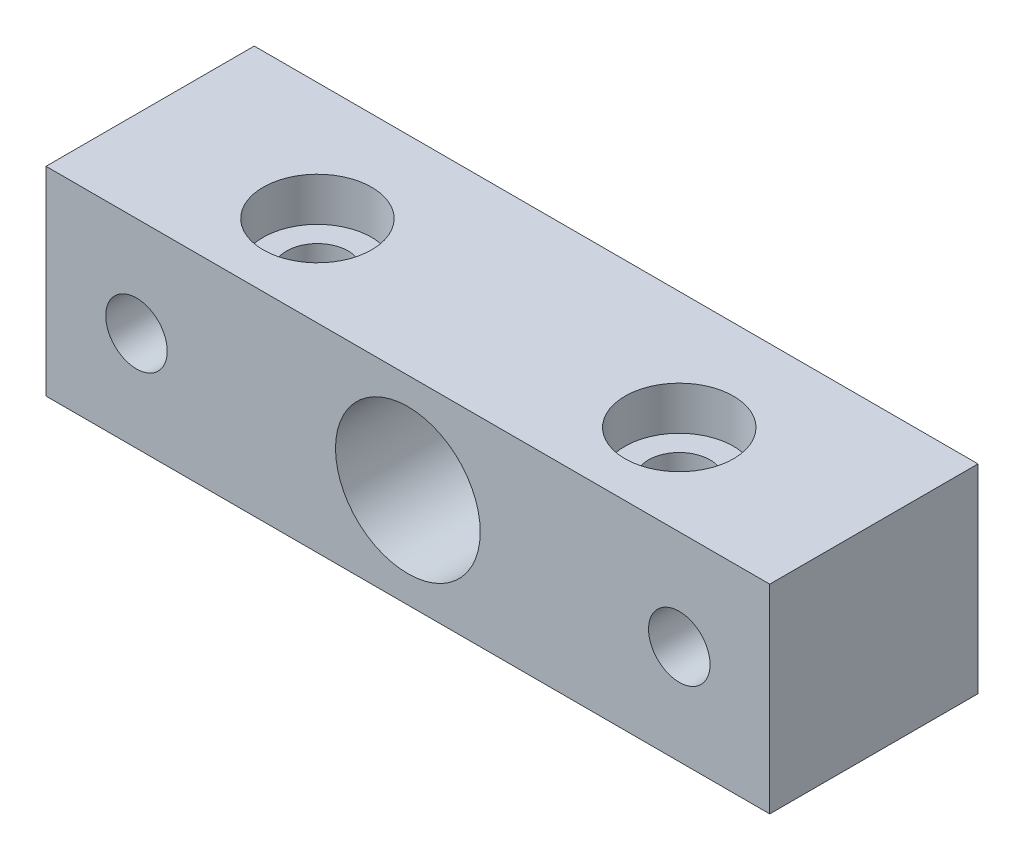
ISO-10303-21;
HEADER;
FILE_DESCRIPTION(('STEP AP214'),'2;1');
FILE_NAME('part.step','',(''),(''),'','','');
FILE_SCHEMA(('AUTOMOTIVE_DESIGN { 1 0 10303 214 1 1 1 1 }'));
ENDSEC;
DATA;
#1=APPLICATION_CONTEXT('core data for automotive mechanical design processes');
#2=APPLICATION_PROTOCOL_DEFINITION('international standard','automotive_design',2000,#1);
#3=PRODUCT_CONTEXT('',#1,'mechanical');
#4=PRODUCT('Part','Part','',(#3));
#5=PRODUCT_RELATED_PRODUCT_CATEGORY('part','',(#4));
#6=PRODUCT_DEFINITION_FORMATION('','',#4);
#7=PRODUCT_DEFINITION_CONTEXT('part definition',#1,'design');
#8=PRODUCT_DEFINITION('design','',#6,#7);
#9=PRODUCT_DEFINITION_SHAPE('','',#8);
#10=(LENGTH_UNIT() NAMED_UNIT(*) SI_UNIT(.MILLI.,.METRE.));
#11=(NAMED_UNIT(*) PLANE_ANGLE_UNIT() SI_UNIT($,.RADIAN.));
#12=(NAMED_UNIT(*) SI_UNIT($,.STERADIAN.) SOLID_ANGLE_UNIT());
#13=UNCERTAINTY_MEASURE_WITH_UNIT(LENGTH_MEASURE(1.E-05),#10,'distance_accuracy_value','');
#14=(GEOMETRIC_REPRESENTATION_CONTEXT(3) GLOBAL_UNCERTAINTY_ASSIGNED_CONTEXT((#13)) GLOBAL_UNIT_ASSIGNED_CONTEXT((#10,
#11,#12)) REPRESENTATION_CONTEXT('',''));
#15=CARTESIAN_POINT('',(0.,0.,0.));
#16=DIRECTION('',(0.,0.,1.));
#17=DIRECTION('',(1.,0.,0.));
#18=AXIS2_PLACEMENT_3D('',#15,#16,#17);
#19=CARTESIAN_POINT('',(-20.,-5.5,10.51));
#20=DIRECTION('',(1.,0.,0.));
#21=DIRECTION('',(0.,1.,0.));
#22=AXIS2_PLACEMENT_3D('',#19,#20,#21);
#23=PLANE('',#22);
#24=DIRECTION('',(0.,1.,0.));
#25=VECTOR('',#24,1.);
#26=CARTESIAN_POINT('',(-20.,-5.5,3.));
#27=LINE('',#26,#25);
#28=CARTESIAN_POINT('',(-20.,-5.5,3.));
#29=VERTEX_POINT('',#28);
#30=CARTESIAN_POINT('',(-20.,5.5,3.));
#31=VERTEX_POINT('',#30);
#32=EDGE_CURVE('E49',#29,#31,#27,.T.);
#33=ORIENTED_EDGE('',*,*,#32,.F.);
#34=DIRECTION('',(0.,0.,-1.));
#35=VECTOR('',#34,1.);
#36=CARTESIAN_POINT('',(-20.,-5.5,10.51));
#37=LINE('',#36,#35);
#38=CARTESIAN_POINT('',(-20.,-5.5,14.51));
#39=VERTEX_POINT('',#38);
#40=EDGE_CURVE('E11',#39,#29,#37,.T.);
#41=ORIENTED_EDGE('',*,*,#40,.F.);
#42=DIRECTION('',(0.,-1.,0.));
#43=VECTOR('',#42,1.);
#44=CARTESIAN_POINT('',(-20.,-5.5,14.51));
#45=LINE('',#44,#43);
#46=CARTESIAN_POINT('',(-20.,5.5,14.51));
#47=VERTEX_POINT('',#46);
#48=EDGE_CURVE('E123',#47,#39,#45,.T.);
#49=ORIENTED_EDGE('',*,*,#48,.F.);
#50=DIRECTION('',(0.,0.,-1.));
#51=VECTOR('',#50,1.);
#52=CARTESIAN_POINT('',(-20.,5.5,10.51));
#53=LINE('',#52,#51);
#54=EDGE_CURVE('E98',#47,#31,#53,.T.);
#55=ORIENTED_EDGE('',*,*,#54,.T.);
#56=EDGE_LOOP('',(#33,#41,#49,#55));
#57=FACE_BOUND('',#56,.T.);
#58=ADVANCED_FACE('F33',(#57),#23,.F.);
#59=CARTESIAN_POINT('',(20.,-5.5,10.51));
#60=DIRECTION('',(0.,1.,0.));
#61=DIRECTION('',(0.,0.,1.));
#62=AXIS2_PLACEMENT_3D('',#59,#60,#61);
#63=PLANE('',#62);
#64=CARTESIAN_POINT('',(9.99999999999999,-5.5,9.51));
#65=DIRECTION('',(0.,1.,0.));
#66=DIRECTION('',(0.,0.,1.));
#67=AXIS2_PLACEMENT_3D('',#64,#65,#66);
#68=CIRCLE('',#67,1.7);
#69=CARTESIAN_POINT('',(9.99999999999999,-5.5,11.21));
#70=VERTEX_POINT('',#69);
#71=EDGE_CURVE('E140',#70,#70,#68,.T.);
#72=ORIENTED_EDGE('',*,*,#71,.T.);
#73=EDGE_LOOP('',(#72));
#74=FACE_BOUND('',#73,.T.);
#75=CARTESIAN_POINT('',(-10.,-5.50000000000001,9.51));
#76=DIRECTION('',(0.,1.,0.));
#77=DIRECTION('',(0.,0.,1.));
#78=AXIS2_PLACEMENT_3D('',#75,#76,#77);
#79=CIRCLE('',#78,1.7);
#80=CARTESIAN_POINT('',(-10.,-5.50000000000001,11.21));
#81=VERTEX_POINT('',#80);
#82=EDGE_CURVE('E101',#81,#81,#79,.T.);
#83=ORIENTED_EDGE('',*,*,#82,.T.);
#84=EDGE_LOOP('',(#83));
#85=FACE_BOUND('',#84,.T.);
#86=DIRECTION('',(-1.,0.,0.));
#87=VECTOR('',#86,1.);
#88=CARTESIAN_POINT('',(20.,-5.5,3.));
#89=LINE('',#88,#87);
#90=CARTESIAN_POINT('',(20.,-5.5,3.));
#91=VERTEX_POINT('',#90);
#92=EDGE_CURVE('E94',#91,#29,#89,.T.);
#93=ORIENTED_EDGE('',*,*,#92,.F.);
#94=DIRECTION('',(0.,0.,-1.));
#95=VECTOR('',#94,1.);
#96=CARTESIAN_POINT('',(20.,-5.5,10.51));
#97=LINE('',#96,#95);
#98=CARTESIAN_POINT('',(20.,-5.5,14.51));
#99=VERTEX_POINT('',#98);
#100=EDGE_CURVE('E41',#99,#91,#97,.T.);
#101=ORIENTED_EDGE('',*,*,#100,.F.);
#102=DIRECTION('',(1.,0.,0.));
#103=VECTOR('',#102,1.);
#104=CARTESIAN_POINT('',(20.,-5.5,14.51));
#105=LINE('',#104,#103);
#106=EDGE_CURVE('E121',#39,#99,#105,.T.);
#107=ORIENTED_EDGE('',*,*,#106,.F.);
#108=ORIENTED_EDGE('',*,*,#40,.T.);
#109=EDGE_LOOP('',(#93,#101,#107,#108));
#110=FACE_BOUND('',#109,.T.);
#111=ADVANCED_FACE('F154',(#74,#85,#110),#63,.F.);
#112=CARTESIAN_POINT('',(20.,-5.5,10.51));
#113=DIRECTION('',(-1.,0.,0.));
#114=DIRECTION('',(0.,0.,1.));
#115=AXIS2_PLACEMENT_3D('',#112,#113,#114);
#116=PLANE('',#115);
#117=DIRECTION('',(0.,-1.,0.));
#118=VECTOR('',#117,1.);
#119=CARTESIAN_POINT('',(20.,-5.5,3.));
#120=LINE('',#119,#118);
#121=CARTESIAN_POINT('',(20.,5.5,3.));
#122=VERTEX_POINT('',#121);
#123=EDGE_CURVE('E81',#122,#91,#120,.T.);
#124=ORIENTED_EDGE('',*,*,#123,.F.);
#125=DIRECTION('',(0.,0.,-1.));
#126=VECTOR('',#125,1.);
#127=CARTESIAN_POINT('',(20.,5.5,10.51));
#128=LINE('',#127,#126);
#129=CARTESIAN_POINT('',(20.,5.5,14.51));
#130=VERTEX_POINT('',#129);
#131=EDGE_CURVE('E92',#130,#122,#128,.T.);
#132=ORIENTED_EDGE('',*,*,#131,.F.);
#133=DIRECTION('',(0.,1.,0.));
#134=VECTOR('',#133,1.);
#135=CARTESIAN_POINT('',(20.,-5.5,14.51));
#136=LINE('',#135,#134);
#137=EDGE_CURVE('E57',#99,#130,#136,.T.);
#138=ORIENTED_EDGE('',*,*,#137,.F.);
#139=ORIENTED_EDGE('',*,*,#100,.T.);
#140=EDGE_LOOP('',(#124,#132,#138,#139));
#141=FACE_BOUND('',#140,.T.);
#142=ADVANCED_FACE('F91',(#141),#116,.F.);
#143=CARTESIAN_POINT('',(20.,5.5,10.51));
#144=DIRECTION('',(0.,-1.,0.));
#145=DIRECTION('',(0.,0.,-1.));
#146=AXIS2_PLACEMENT_3D('',#143,#144,#145);
#147=PLANE('',#146);
#148=CARTESIAN_POINT('',(9.99999999999999,5.5,9.51));
#149=DIRECTION('',(0.,1.,0.));
#150=DIRECTION('',(0.,0.,1.));
#151=AXIS2_PLACEMENT_3D('',#148,#149,#150);
#152=CIRCLE('',#151,3.);
#153=CARTESIAN_POINT('',(9.99999999999999,5.5,12.51));
#154=VERTEX_POINT('',#153);
#155=EDGE_CURVE('E131',#154,#154,#152,.T.);
#156=ORIENTED_EDGE('',*,*,#155,.F.);
#157=EDGE_LOOP('',(#156));
#158=FACE_BOUND('',#157,.T.);
#159=CARTESIAN_POINT('',(-10.,5.5,9.51));
#160=DIRECTION('',(0.,1.,0.));
#161=DIRECTION('',(0.,0.,1.));
#162=AXIS2_PLACEMENT_3D('',#159,#160,#161);
#163=CIRCLE('',#162,3.);
#164=CARTESIAN_POINT('',(-10.,5.5,12.51));
#165=VERTEX_POINT('',#164);
#166=EDGE_CURVE('E143',#165,#165,#163,.T.);
#167=ORIENTED_EDGE('',*,*,#166,.F.);
#168=EDGE_LOOP('',(#167));
#169=FACE_BOUND('',#168,.T.);
#170=DIRECTION('',(1.,0.,0.));
#171=VECTOR('',#170,1.);
#172=CARTESIAN_POINT('',(20.,5.5,3.));
#173=LINE('',#172,#171);
#174=EDGE_CURVE('E78',#31,#122,#173,.T.);
#175=ORIENTED_EDGE('',*,*,#174,.F.);
#176=ORIENTED_EDGE('',*,*,#54,.F.);
#177=DIRECTION('',(-1.,0.,0.));
#178=VECTOR('',#177,1.);
#179=CARTESIAN_POINT('',(20.,5.5,14.51));
#180=LINE('',#179,#178);
#181=EDGE_CURVE('E97',#130,#47,#180,.T.);
#182=ORIENTED_EDGE('',*,*,#181,.F.);
#183=ORIENTED_EDGE('',*,*,#131,.T.);
#184=EDGE_LOOP('',(#175,#176,#182,#183));
#185=FACE_BOUND('',#184,.T.);
#186=ADVANCED_FACE('F96',(#158,#169,#185),#147,.F.);
#187=CARTESIAN_POINT('',(0.,0.,10.51));
#188=DIRECTION('',(0.,0.,-1.));
#189=DIRECTION('',(-1.,0.,0.));
#190=AXIS2_PLACEMENT_3D('',#187,#188,#189);
#191=CYLINDRICAL_SURFACE('',#190,4.);
#192=CARTESIAN_POINT('',(0.,0.,14.51));
#193=DIRECTION('',(0.,0.,1.));
#194=DIRECTION('',(1.,0.,0.));
#195=AXIS2_PLACEMENT_3D('',#192,#193,#194);
#196=CIRCLE('',#195,4.);
#197=CARTESIAN_POINT('',(4.,0.,14.51));
#198=VERTEX_POINT('',#197);
#199=EDGE_CURVE('E107',#198,#198,#196,.T.);
#200=ORIENTED_EDGE('',*,*,#199,.T.);
#201=EDGE_LOOP('',(#200));
#202=FACE_BOUND('',#201,.T.);
#203=CARTESIAN_POINT('',(0.,0.,3.));
#204=DIRECTION('',(0.,0.,-1.));
#205=DIRECTION('',(-1.,0.,0.));
#206=AXIS2_PLACEMENT_3D('',#203,#204,#205);
#207=CIRCLE('',#206,4.);
#208=CARTESIAN_POINT('',(-4.,0.,3.));
#209=VERTEX_POINT('',#208);
#210=EDGE_CURVE('E36',#209,#209,#207,.T.);
#211=ORIENTED_EDGE('',*,*,#210,.T.);
#212=EDGE_LOOP('',(#211));
#213=FACE_BOUND('',#212,.T.);
#214=ADVANCED_FACE('F161',(#202,#213),#191,.F.);
#215=CARTESIAN_POINT('',(-10.,5.5,9.51));
#216=DIRECTION('',(0.,1.,0.));
#217=DIRECTION('',(0.,0.,1.));
#218=AXIS2_PLACEMENT_3D('',#215,#216,#217);
#219=CYLINDRICAL_SURFACE('',#218,1.7);
#220=ORIENTED_EDGE('',*,*,#82,.F.);
#221=EDGE_LOOP('',(#220));
#222=FACE_BOUND('',#221,.T.);
#223=CARTESIAN_POINT('',(-10.,3.1,9.51));
#224=DIRECTION('',(0.,1.,0.));
#225=DIRECTION('',(0.,0.,1.));
#226=AXIS2_PLACEMENT_3D('',#223,#224,#225);
#227=CIRCLE('',#226,1.7);
#228=CARTESIAN_POINT('',(-10.,3.1,11.21));
#229=VERTEX_POINT('',#228);
#230=EDGE_CURVE('E149',#229,#229,#227,.T.);
#231=ORIENTED_EDGE('',*,*,#230,.T.);
#232=EDGE_LOOP('',(#231));
#233=FACE_BOUND('',#232,.T.);
#234=ADVANCED_FACE('F157',(#222,#233),#219,.F.);
#235=CARTESIAN_POINT('',(-8.30000000000001,3.1,9.51));
#236=DIRECTION('',(0.,-1.,0.));
#237=DIRECTION('',(0.,0.,-1.));
#238=AXIS2_PLACEMENT_3D('',#235,#236,#237);
#239=PLANE('',#238);
#240=ORIENTED_EDGE('',*,*,#230,.F.);
#241=EDGE_LOOP('',(#240));
#242=FACE_BOUND('',#241,.T.);
#243=CARTESIAN_POINT('',(-10.,3.1,9.51));
#244=DIRECTION('',(0.,1.,0.));
#245=DIRECTION('',(0.,0.,1.));
#246=AXIS2_PLACEMENT_3D('',#243,#244,#245);
#247=CIRCLE('',#246,3.);
#248=CARTESIAN_POINT('',(-10.,3.1,12.51));
#249=VERTEX_POINT('',#248);
#250=EDGE_CURVE('E146',#249,#249,#247,.T.);
#251=ORIENTED_EDGE('',*,*,#250,.T.);
#252=EDGE_LOOP('',(#251));
#253=FACE_BOUND('',#252,.T.);
#254=ADVANCED_FACE('F160',(#242,#253),#239,.F.);
#255=CARTESIAN_POINT('',(-10.,5.5,9.51));
#256=DIRECTION('',(0.,1.,0.));
#257=DIRECTION('',(0.,0.,1.));
#258=AXIS2_PLACEMENT_3D('',#255,#256,#257);
#259=CYLINDRICAL_SURFACE('',#258,3.);
#260=ORIENTED_EDGE('',*,*,#250,.F.);
#261=EDGE_LOOP('',(#260));
#262=FACE_BOUND('',#261,.T.);
#263=ORIENTED_EDGE('',*,*,#166,.T.);
#264=EDGE_LOOP('',(#263));
#265=FACE_BOUND('',#264,.T.);
#266=ADVANCED_FACE('F167',(#262,#265),#259,.F.);
#267=CARTESIAN_POINT('',(9.99999999999999,5.5,9.51));
#268=DIRECTION('',(0.,1.,0.));
#269=DIRECTION('',(0.,0.,1.));
#270=AXIS2_PLACEMENT_3D('',#267,#268,#269);
#271=CYLINDRICAL_SURFACE('',#270,1.7);
#272=ORIENTED_EDGE('',*,*,#71,.F.);
#273=EDGE_LOOP('',(#272));
#274=FACE_BOUND('',#273,.T.);
#275=CARTESIAN_POINT('',(9.99999999999999,3.1,9.51));
#276=DIRECTION('',(0.,1.,0.));
#277=DIRECTION('',(0.,0.,1.));
#278=AXIS2_PLACEMENT_3D('',#275,#276,#277);
#279=CIRCLE('',#278,1.7);
#280=CARTESIAN_POINT('',(9.99999999999999,3.1,11.21));
#281=VERTEX_POINT('',#280);
#282=EDGE_CURVE('E137',#281,#281,#279,.T.);
#283=ORIENTED_EDGE('',*,*,#282,.T.);
#284=EDGE_LOOP('',(#283));
#285=FACE_BOUND('',#284,.T.);
#286=ADVANCED_FACE('F173',(#274,#285),#271,.F.);
#287=CARTESIAN_POINT('',(11.7,3.1,9.51));
#288=DIRECTION('',(0.,-1.,0.));
#289=DIRECTION('',(0.,0.,-1.));
#290=AXIS2_PLACEMENT_3D('',#287,#288,#289);
#291=PLANE('',#290);
#292=ORIENTED_EDGE('',*,*,#282,.F.);
#293=EDGE_LOOP('',(#292));
#294=FACE_BOUND('',#293,.T.);
#295=CARTESIAN_POINT('',(9.99999999999999,3.1,9.51));
#296=DIRECTION('',(0.,1.,0.));
#297=DIRECTION('',(0.,0.,1.));
#298=AXIS2_PLACEMENT_3D('',#295,#296,#297);
#299=CIRCLE('',#298,3.);
#300=CARTESIAN_POINT('',(9.99999999999999,3.1,12.51));
#301=VERTEX_POINT('',#300);
#302=EDGE_CURVE('E134',#301,#301,#299,.T.);
#303=ORIENTED_EDGE('',*,*,#302,.T.);
#304=EDGE_LOOP('',(#303));
#305=FACE_BOUND('',#304,.T.);
#306=ADVANCED_FACE('F209',(#294,#305),#291,.F.);
#307=CARTESIAN_POINT('',(9.99999999999999,5.5,9.51));
#308=DIRECTION('',(0.,1.,0.));
#309=DIRECTION('',(0.,0.,1.));
#310=AXIS2_PLACEMENT_3D('',#307,#308,#309);
#311=CYLINDRICAL_SURFACE('',#310,3.);
#312=ORIENTED_EDGE('',*,*,#302,.F.);
#313=EDGE_LOOP('',(#312));
#314=FACE_BOUND('',#313,.T.);
#315=ORIENTED_EDGE('',*,*,#155,.T.);
#316=EDGE_LOOP('',(#315));
#317=FACE_BOUND('',#316,.T.);
#318=ADVANCED_FACE('F199',(#314,#317),#311,.F.);
#319=CARTESIAN_POINT('',(0.,0.,14.51));
#320=DIRECTION('',(0.,0.,1.));
#321=DIRECTION('',(1.,0.,0.));
#322=AXIS2_PLACEMENT_3D('',#319,#320,#321);
#323=PLANE('',#322);
#324=ORIENTED_EDGE('',*,*,#199,.F.);
#325=EDGE_LOOP('',(#324));
#326=FACE_BOUND('',#325,.T.);
#327=CARTESIAN_POINT('',(15.,0.,14.51));
#328=DIRECTION('',(0.,0.,1.));
#329=DIRECTION('',(1.,0.,0.));
#330=AXIS2_PLACEMENT_3D('',#327,#328,#329);
#331=CIRCLE('',#330,1.7);
#332=CARTESIAN_POINT('',(16.7,0.,14.51));
#333=VERTEX_POINT('',#332);
#334=EDGE_CURVE('E106',#333,#333,#331,.F.);
#335=ORIENTED_EDGE('',*,*,#334,.T.);
#336=EDGE_LOOP('',(#335));
#337=FACE_BOUND('',#336,.T.);
#338=CARTESIAN_POINT('',(-15.,0.,14.51));
#339=DIRECTION('',(0.,0.,1.));
#340=DIRECTION('',(1.,0.,0.));
#341=AXIS2_PLACEMENT_3D('',#338,#339,#340);
#342=CIRCLE('',#341,1.7);
#343=CARTESIAN_POINT('',(-13.3,0.,14.51));
#344=VERTEX_POINT('',#343);
#345=EDGE_CURVE('E104',#344,#344,#342,.F.);
#346=ORIENTED_EDGE('',*,*,#345,.T.);
#347=EDGE_LOOP('',(#346));
#348=FACE_BOUND('',#347,.T.);
#349=ORIENTED_EDGE('',*,*,#48,.T.);
#350=ORIENTED_EDGE('',*,*,#106,.T.);
#351=ORIENTED_EDGE('',*,*,#137,.T.);
#352=ORIENTED_EDGE('',*,*,#181,.T.);
#353=EDGE_LOOP('',(#349,#350,#351,#352));
#354=FACE_BOUND('',#353,.T.);
#355=ADVANCED_FACE('F196',(#326,#337,#348,#354),#323,.T.);
#356=CARTESIAN_POINT('',(15.,0.,9.51));
#357=DIRECTION('',(0.,0.,1.));
#358=DIRECTION('',(1.,0.,0.));
#359=AXIS2_PLACEMENT_3D('',#356,#357,#358);
#360=CONICAL_SURFACE('',#359,1.7,1.02974425867665);
#361=CARTESIAN_POINT('',(15.,0.,8.48853694765315));
#362=VERTEX_POINT('',#361);
#363=VERTEX_LOOP('',#362);
#364=FACE_BOUND('',#363,.T.);
#365=CARTESIAN_POINT('',(15.,0.,9.51));
#366=DIRECTION('',(0.,0.,1.));
#367=DIRECTION('',(1.,0.,0.));
#368=AXIS2_PLACEMENT_3D('',#365,#366,#367);
#369=CIRCLE('',#368,1.7);
#370=CARTESIAN_POINT('',(16.7,0.,9.51));
#371=VERTEX_POINT('',#370);
#372=EDGE_CURVE('E128',#371,#371,#369,.T.);
#373=ORIENTED_EDGE('',*,*,#372,.T.);
#374=EDGE_LOOP('',(#373));
#375=FACE_BOUND('',#374,.T.);
#376=ADVANCED_FACE('F198',(#364,#375),#360,.F.);
#377=CARTESIAN_POINT('',(15.,0.,17.51));
#378=DIRECTION('',(0.,0.,1.));
#379=DIRECTION('',(1.,0.,0.));
#380=AXIS2_PLACEMENT_3D('',#377,#378,#379);
#381=CYLINDRICAL_SURFACE('',#380,1.7);
#382=ORIENTED_EDGE('',*,*,#372,.F.);
#383=EDGE_LOOP('',(#382));
#384=FACE_BOUND('',#383,.T.);
#385=ORIENTED_EDGE('',*,*,#334,.F.);
#386=EDGE_LOOP('',(#385));
#387=FACE_BOUND('',#386,.T.);
#388=ADVANCED_FACE('F206',(#384,#387),#381,.F.);
#389=CARTESIAN_POINT('',(-15.,0.,9.51));
#390=DIRECTION('',(0.,0.,1.));
#391=DIRECTION('',(1.,0.,0.));
#392=AXIS2_PLACEMENT_3D('',#389,#390,#391);
#393=CONICAL_SURFACE('',#392,1.7,1.02974425867665);
#394=CARTESIAN_POINT('',(-15.,0.,8.48853694765315));
#395=VERTEX_POINT('',#394);
#396=VERTEX_LOOP('',#395);
#397=FACE_BOUND('',#396,.T.);
#398=CARTESIAN_POINT('',(-15.,0.,9.51));
#399=DIRECTION('',(0.,0.,1.));
#400=DIRECTION('',(1.,0.,0.));
#401=AXIS2_PLACEMENT_3D('',#398,#399,#400);
#402=CIRCLE('',#401,1.7);
#403=CARTESIAN_POINT('',(-13.3,0.,9.51));
#404=VERTEX_POINT('',#403);
#405=EDGE_CURVE('E125',#404,#404,#402,.T.);
#406=ORIENTED_EDGE('',*,*,#405,.T.);
#407=EDGE_LOOP('',(#406));
#408=FACE_BOUND('',#407,.T.);
#409=ADVANCED_FACE('F218',(#397,#408),#393,.F.);
#410=CARTESIAN_POINT('',(-15.,0.,17.51));
#411=DIRECTION('',(0.,0.,1.));
#412=DIRECTION('',(1.,0.,0.));
#413=AXIS2_PLACEMENT_3D('',#410,#411,#412);
#414=CYLINDRICAL_SURFACE('',#413,1.7);
#415=ORIENTED_EDGE('',*,*,#405,.F.);
#416=EDGE_LOOP('',(#415));
#417=FACE_BOUND('',#416,.T.);
#418=ORIENTED_EDGE('',*,*,#345,.F.);
#419=EDGE_LOOP('',(#418));
#420=FACE_BOUND('',#419,.T.);
#421=ADVANCED_FACE('F215',(#417,#420),#414,.F.);
#422=CARTESIAN_POINT('',(0.,0.,3.));
#423=DIRECTION('',(0.,0.,-1.));
#424=DIRECTION('',(-1.,0.,0.));
#425=AXIS2_PLACEMENT_3D('',#422,#423,#424);
#426=PLANE('',#425);
#427=ORIENTED_EDGE('',*,*,#210,.F.);
#428=EDGE_LOOP('',(#427));
#429=FACE_BOUND('',#428,.T.);
#430=ORIENTED_EDGE('',*,*,#32,.T.);
#431=ORIENTED_EDGE('',*,*,#174,.T.);
#432=ORIENTED_EDGE('',*,*,#123,.T.);
#433=ORIENTED_EDGE('',*,*,#92,.T.);
#434=EDGE_LOOP('',(#430,#431,#432,#433));
#435=FACE_BOUND('',#434,.T.);
#436=ADVANCED_FACE('F80',(#429,#435),#426,.T.);
#437=CLOSED_SHELL('',(#58,#111,#142,#186,#214,#234,#254,#266,#286,#306,#318,#355,#376,#388,#409,
#421,#436));
#438=MANIFOLD_SOLID_BREP('B2',#437);
#439=ADVANCED_BREP_SHAPE_REPRESENTATION('',(#18,#438),#14);
#440=SHAPE_DEFINITION_REPRESENTATION(#9,#439);
ENDSEC;
END-ISO-10303-21;
